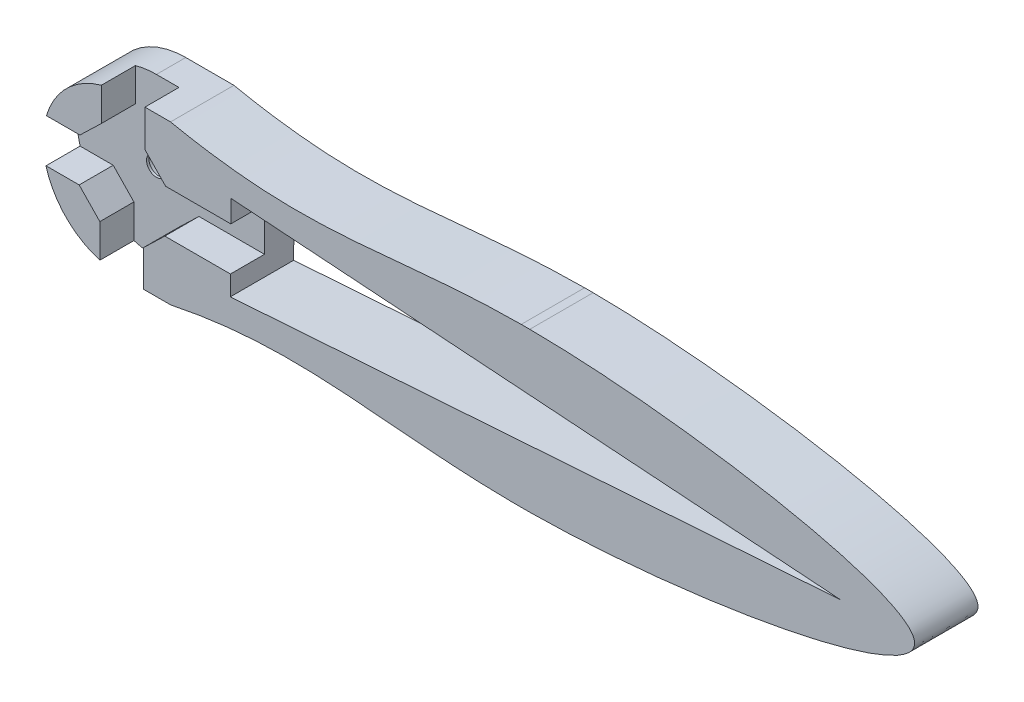
ISO-10303-21;
HEADER;
FILE_DESCRIPTION(('STEP AP214'),'2;1');
FILE_NAME('part.step','',(''),(''),'','','');
FILE_SCHEMA(('AUTOMOTIVE_DESIGN { 1 0 10303 214 1 1 1 1 }'));
ENDSEC;
DATA;
#1=APPLICATION_CONTEXT('core data for automotive mechanical design processes');
#2=APPLICATION_PROTOCOL_DEFINITION('international standard','automotive_design',2000,#1);
#3=PRODUCT_CONTEXT('',#1,'mechanical');
#4=PRODUCT('Part','Part','',(#3));
#5=PRODUCT_RELATED_PRODUCT_CATEGORY('part','',(#4));
#6=PRODUCT_DEFINITION_FORMATION('','',#4);
#7=PRODUCT_DEFINITION_CONTEXT('part definition',#1,'design');
#8=PRODUCT_DEFINITION('design','',#6,#7);
#9=PRODUCT_DEFINITION_SHAPE('','',#8);
#10=(LENGTH_UNIT() NAMED_UNIT(*) SI_UNIT(.MILLI.,.METRE.));
#11=(NAMED_UNIT(*) PLANE_ANGLE_UNIT() SI_UNIT($,.RADIAN.));
#12=(NAMED_UNIT(*) SI_UNIT($,.STERADIAN.) SOLID_ANGLE_UNIT());
#13=UNCERTAINTY_MEASURE_WITH_UNIT(LENGTH_MEASURE(1.E-05),#10,'distance_accuracy_value','');
#14=(GEOMETRIC_REPRESENTATION_CONTEXT(3) GLOBAL_UNCERTAINTY_ASSIGNED_CONTEXT((#13)) GLOBAL_UNIT_ASSIGNED_CONTEXT((#10,
#11,#12)) REPRESENTATION_CONTEXT('',''));
#15=CARTESIAN_POINT('',(0.,0.,0.));
#16=DIRECTION('',(0.,0.,1.));
#17=DIRECTION('',(1.,0.,0.));
#18=AXIS2_PLACEMENT_3D('',#15,#16,#17);
#19=CARTESIAN_POINT('',(0.,10.,8.));
#20=DIRECTION('',(0.,0.,-1.));
#21=DIRECTION('',(-1.,0.,0.));
#22=AXIS2_PLACEMENT_3D('',#19,#20,#21);
#23=PLANE('',#22);
#24=DIRECTION('',(0.99754531479736,0.0700238882513403,0.));
#25=VECTOR('',#24,1.);
#26=CARTESIAN_POINT('',(90.6551442776902,10.0481178062862,8.));
#27=LINE('',#26,#25);
#28=CARTESIAN_POINT('',(13.6163287176374,4.6402858694598,8.));
#29=VERTEX_POINT('',#28);
#30=CARTESIAN_POINT('',(90.6551442776902,10.0481178062862,8.));
#31=VERTEX_POINT('',#30);
#32=EDGE_CURVE('E224',#29,#31,#27,.T.);
#33=ORIENTED_EDGE('',*,*,#32,.F.);
#34=DIRECTION('',(-0.00874835726051306,-0.999961732390416,0.));
#35=VECTOR('',#34,1.);
#36=CARTESIAN_POINT('',(13.6163287176374,4.6402858694598,8.));
#37=LINE('',#36,#35);
#38=CARTESIAN_POINT('',(13.6383324761862,7.15537708743099,8.));
#39=VERTEX_POINT('',#38);
#40=EDGE_CURVE('E233',#39,#29,#37,.T.);
#41=ORIENTED_EDGE('',*,*,#40,.F.);
#42=DIRECTION('',(1.,0.,0.));
#43=VECTOR('',#42,1.);
#44=CARTESIAN_POINT('',(17.8180971034863,7.15537708743099,8.));
#45=LINE('',#44,#43);
#46=CARTESIAN_POINT('',(5.3597141305402,7.15537708743099,8.));
#47=VERTEX_POINT('',#46);
#48=EDGE_CURVE('E493',#47,#39,#45,.T.);
#49=ORIENTED_EDGE('',*,*,#48,.F.);
#50=DIRECTION('',(0.719369188088886,0.694627937264502,0.));
#51=VECTOR('',#50,1.);
#52=CARTESIAN_POINT('',(2.65537708743099,4.54405025688731,8.));
#53=LINE('',#52,#51);
#54=CARTESIAN_POINT('',(2.65537708743099,4.54405025688731,8.));
#55=VERTEX_POINT('',#54);
#56=EDGE_CURVE('E490',#55,#47,#53,.T.);
#57=ORIENTED_EDGE('',*,*,#56,.F.);
#58=DIRECTION('',(0.,1.,0.));
#59=VECTOR('',#58,1.);
#60=CARTESIAN_POINT('',(2.65537708743099,4.54405025688731,8.));
#61=LINE('',#60,#59);
#62=CARTESIAN_POINT('',(2.65537708743099,0.,8.));
#63=VERTEX_POINT('',#62);
#64=EDGE_CURVE('E372',#63,#55,#61,.T.);
#65=ORIENTED_EDGE('',*,*,#64,.F.);
#66=DIRECTION('',(1.,0.,0.));
#67=VECTOR('',#66,1.);
#68=CARTESIAN_POINT('',(0.,0.,8.));
#69=LINE('',#68,#67);
#70=CARTESIAN_POINT('',(6.07871364216808,0.,8.));
#71=VERTEX_POINT('',#70);
#72=EDGE_CURVE('E358',#63,#71,#69,.T.);
#73=ORIENTED_EDGE('',*,*,#72,.T.);
#74=CARTESIAN_POINT('',(6.07871364216805,20.,8.));
#75=CARTESIAN_POINT('',(-5.18394902423319,22.3429310877727,8.));
#76=CARTESIAN_POINT('',(-23.1517395103829,28.6346292808454,8.));
#77=CARTESIAN_POINT('',(-18.3293462074363,-7.41752010195064,8.));
#78=CARTESIAN_POINT('',(17.5692357205584,5.73226547633476,8.));
#79=CARTESIAN_POINT('',(44.5395748380323,-4.28840837775069,8.));
#80=CARTESIAN_POINT('',(129.17258816673,9.95529611012485,8.));
#81=CARTESIAN_POINT('',(43.7729465159057,24.459557564696,8.));
#82=CARTESIAN_POINT('',(24.915023513552,16.0815504038632,8.));
#83=CARTESIAN_POINT('',(6.07871364216805,20.,8.));
#84=B_SPLINE_CURVE_WITH_KNOTS('',3,(#74,#75,#76,#77,#78,#79,#80,#81,#82,#83),.UNSPECIFIED.,.T.,
.F.,(4,1,1,1,1,1,1,4),(0.,0.109135562905319,0.132702059093896,0.235664961885761,
0.418189409413175,0.617832480942881,0.817475552472586,1.),.UNSPECIFIED.);
#85=CARTESIAN_POINT('',(49.1099394503399,-2.04914549412939E-12,8.));
#86=VERTEX_POINT('',#85);
#87=EDGE_CURVE('E369',#71,#86,#84,.T.);
#88=ORIENTED_EDGE('',*,*,#87,.T.);
#89=CARTESIAN_POINT('',(51.4223114562844,0.,8.));
#90=VERTEX_POINT('',#89);
#91=EDGE_CURVE('E374',#86,#90,#69,.T.);
#92=ORIENTED_EDGE('',*,*,#91,.T.);
#93=CARTESIAN_POINT('',(51.4223114562801,20.,8.));
#94=VERTEX_POINT('',#93);
#95=EDGE_CURVE('E420',#90,#94,#84,.T.);
#96=ORIENTED_EDGE('',*,*,#95,.T.);
#97=DIRECTION('',(-1.,0.,0.));
#98=VECTOR('',#97,1.);
#99=CARTESIAN_POINT('',(0.,20.,8.));
#100=LINE('',#99,#98);
#101=CARTESIAN_POINT('',(50.3451744032018,20.,8.));
#102=VERTEX_POINT('',#101);
#103=EDGE_CURVE('E376',#94,#102,#100,.T.);
#104=ORIENTED_EDGE('',*,*,#103,.T.);
#105=CARTESIAN_POINT('',(6.07871364216805,20.,8.));
#106=VERTEX_POINT('',#105);
#107=EDGE_CURVE('E245',#102,#106,#84,.T.);
#108=ORIENTED_EDGE('',*,*,#107,.T.);
#109=CARTESIAN_POINT('',(2.84462291256901,20.,8.));
#110=VERTEX_POINT('',#109);
#111=EDGE_CURVE('E373',#106,#110,#100,.T.);
#112=ORIENTED_EDGE('',*,*,#111,.T.);
#113=DIRECTION('',(0.,1.,0.));
#114=VECTOR('',#113,1.);
#115=CARTESIAN_POINT('',(2.84462291256901,15.3597141305402,8.));
#116=LINE('',#115,#114);
#117=CARTESIAN_POINT('',(2.84462291256901,15.3597141305402,8.));
#118=VERTEX_POINT('',#117);
#119=EDGE_CURVE('E444',#118,#110,#116,.T.);
#120=ORIENTED_EDGE('',*,*,#119,.F.);
#121=DIRECTION('',(-0.694627937264501,0.719369188088887,0.));
#122=VECTOR('',#121,1.);
#123=CARTESIAN_POINT('',(5.45594974311269,12.655377087431,8.));
#124=LINE('',#123,#122);
#125=CARTESIAN_POINT('',(5.45594974311269,12.655377087431,8.));
#126=VERTEX_POINT('',#125);
#127=EDGE_CURVE('E498',#126,#118,#124,.T.);
#128=ORIENTED_EDGE('',*,*,#127,.F.);
#129=DIRECTION('',(-1.,0.,0.));
#130=VECTOR('',#129,1.);
#131=CARTESIAN_POINT('',(5.45594974311269,12.655377087431,8.));
#132=LINE('',#131,#130);
#133=CARTESIAN_POINT('',(13.6864502824725,12.655377087431,8.));
#134=VERTEX_POINT('',#133);
#135=EDGE_CURVE('E496',#134,#126,#132,.T.);
#136=ORIENTED_EDGE('',*,*,#135,.F.);
#137=CARTESIAN_POINT('',(13.7109516302064,15.4559497431127,8.));
#138=VERTEX_POINT('',#137);
#139=EDGE_CURVE('E221',#138,#134,#37,.T.);
#140=ORIENTED_EDGE('',*,*,#139,.F.);
#141=DIRECTION('',(-0.997539296015974,0.0701095778332397,0.));
#142=VECTOR('',#141,1.);
#143=CARTESIAN_POINT('',(13.7109516302064,15.4559497431127,8.));
#144=LINE('',#143,#142);
#145=EDGE_CURVE('E216',#31,#138,#144,.T.);
#146=ORIENTED_EDGE('',*,*,#145,.F.);
#147=EDGE_LOOP('',(#33,#41,#49,#57,#65,#73,#88,#92,#96,#104,#108,#112,#120,#128,#136,#140,#146));
#148=FACE_BOUND('',#147,.T.);
#149=ADVANCED_FACE('F36',(#148),#23,.F.);
#150=CARTESIAN_POINT('',(0.,0.,8.));
#151=DIRECTION('',(0.,1.,0.));
#152=DIRECTION('',(0.,0.,1.));
#153=AXIS2_PLACEMENT_3D('',#150,#151,#152);
#154=PLANE('',#153);
#155=DIRECTION('',(0.,0.,1.));
#156=VECTOR('',#155,1.);
#157=CARTESIAN_POINT('',(6.07871364216808,0.,-2.));
#158=LINE('',#157,#156);
#159=CARTESIAN_POINT('',(6.0787135491501,0.,0.));
#160=VERTEX_POINT('',#159);
#161=EDGE_CURVE('E355',#71,#160,#158,.F.);
#162=ORIENTED_EDGE('',*,*,#161,.F.);
#163=ORIENTED_EDGE('',*,*,#72,.F.);
#164=DIRECTION('',(0.,0.,-1.));
#165=VECTOR('',#164,1.);
#166=CARTESIAN_POINT('',(2.65537708743099,0.,8.));
#167=LINE('',#166,#165);
#168=CARTESIAN_POINT('',(2.65537708743099,0.,3.7));
#169=VERTEX_POINT('',#168);
#170=EDGE_CURVE('E541',#63,#169,#167,.T.);
#171=ORIENTED_EDGE('',*,*,#170,.T.);
#172=DIRECTION('',(-1.,0.,0.));
#173=VECTOR('',#172,1.);
#174=CARTESIAN_POINT('',(0.,0.,3.7));
#175=LINE('',#174,#173);
#176=CARTESIAN_POINT('',(0.,0.,3.7));
#177=VERTEX_POINT('',#176);
#178=EDGE_CURVE('E527',#169,#177,#175,.T.);
#179=ORIENTED_EDGE('',*,*,#178,.T.);
#180=DIRECTION('',(0.,0.,-1.));
#181=VECTOR('',#180,1.);
#182=CARTESIAN_POINT('',(0.,0.,8.));
#183=LINE('',#182,#181);
#184=CARTESIAN_POINT('',(0.,0.,0.));
#185=VERTEX_POINT('',#184);
#186=EDGE_CURVE('E395',#177,#185,#183,.T.);
#187=ORIENTED_EDGE('',*,*,#186,.T.);
#188=DIRECTION('',(1.,0.,0.));
#189=VECTOR('',#188,1.);
#190=CARTESIAN_POINT('',(0.,0.,0.));
#191=LINE('',#190,#189);
#192=EDGE_CURVE('E360',#185,#160,#191,.T.);
#193=ORIENTED_EDGE('',*,*,#192,.T.);
#194=EDGE_LOOP('',(#162,#163,#171,#179,#187,#193));
#195=FACE_BOUND('',#194,.T.);
#196=ADVANCED_FACE('F344',(#195),#154,.F.);
#197=DIRECTION('',(0.,0.,1.));
#198=VECTOR('',#197,1.);
#199=CARTESIAN_POINT('',(49.1099394503284,-1.94514509479961E-12,-2.));
#200=LINE('',#199,#198);
#201=CARTESIAN_POINT('',(49.1099394832346,-3.01009842661811E-10,0.));
#202=VERTEX_POINT('',#201);
#203=EDGE_CURVE('E364',#202,#86,#200,.T.);
#204=ORIENTED_EDGE('',*,*,#203,.F.);
#205=CARTESIAN_POINT('',(51.4223114281471,0.,0.));
#206=VERTEX_POINT('',#205);
#207=EDGE_CURVE('E386',#202,#206,#191,.T.);
#208=ORIENTED_EDGE('',*,*,#207,.T.);
#209=DIRECTION('',(0.,0.,1.));
#210=VECTOR('',#209,1.);
#211=CARTESIAN_POINT('',(51.4223114562844,0.,-2.));
#212=LINE('',#211,#210);
#213=EDGE_CURVE('E419',#90,#206,#212,.F.);
#214=ORIENTED_EDGE('',*,*,#213,.F.);
#215=ORIENTED_EDGE('',*,*,#91,.F.);
#216=EDGE_LOOP('',(#204,#208,#214,#215));
#217=FACE_BOUND('',#216,.T.);
#218=ADVANCED_FACE('F342',(#217),#154,.F.);
#219=CARTESIAN_POINT('',(0.,20.,8.));
#220=DIRECTION('',(0.,-1.,0.));
#221=DIRECTION('',(0.,0.,-1.));
#222=AXIS2_PLACEMENT_3D('',#219,#220,#221);
#223=PLANE('',#222);
#224=DIRECTION('',(0.,0.,1.));
#225=VECTOR('',#224,1.);
#226=CARTESIAN_POINT('',(51.4223114562794,20.,-2.));
#227=LINE('',#226,#225);
#228=CARTESIAN_POINT('',(51.4223110359447,20.0000000019914,0.));
#229=VERTEX_POINT('',#228);
#230=EDGE_CURVE('E363',#229,#94,#227,.T.);
#231=ORIENTED_EDGE('',*,*,#230,.F.);
#232=DIRECTION('',(-1.,0.,0.));
#233=VECTOR('',#232,1.);
#234=CARTESIAN_POINT('',(0.,20.,0.));
#235=LINE('',#234,#233);
#236=CARTESIAN_POINT('',(50.3451749231542,20.,0.));
#237=VERTEX_POINT('',#236);
#238=EDGE_CURVE('E391',#229,#237,#235,.T.);
#239=ORIENTED_EDGE('',*,*,#238,.T.);
#240=DIRECTION('',(0.,0.,1.));
#241=VECTOR('',#240,1.);
#242=CARTESIAN_POINT('',(50.3451744031985,20.,-2.));
#243=LINE('',#242,#241);
#244=EDGE_CURVE('E426',#102,#237,#243,.F.);
#245=ORIENTED_EDGE('',*,*,#244,.F.);
#246=ORIENTED_EDGE('',*,*,#103,.F.);
#247=EDGE_LOOP('',(#231,#239,#245,#246));
#248=FACE_BOUND('',#247,.T.);
#249=ADVANCED_FACE('F340',(#248),#223,.F.);
#250=DIRECTION('',(0.,0.,1.));
#251=VECTOR('',#250,1.);
#252=CARTESIAN_POINT('',(6.07871364216784,20.,-2.));
#253=LINE('',#252,#251);
#254=CARTESIAN_POINT('',(6.07871364216805,20.,0.));
#255=VERTEX_POINT('',#254);
#256=EDGE_CURVE('E424',#255,#106,#253,.T.);
#257=ORIENTED_EDGE('',*,*,#256,.F.);
#258=CARTESIAN_POINT('',(0.,20.,0.));
#259=VERTEX_POINT('',#258);
#260=EDGE_CURVE('E389',#255,#259,#235,.T.);
#261=ORIENTED_EDGE('',*,*,#260,.T.);
#262=DIRECTION('',(0.,0.,-1.));
#263=VECTOR('',#262,1.);
#264=CARTESIAN_POINT('',(0.,20.,8.));
#265=LINE('',#264,#263);
#266=CARTESIAN_POINT('',(0.,20.,3.7));
#267=VERTEX_POINT('',#266);
#268=EDGE_CURVE('E392',#267,#259,#265,.T.);
#269=ORIENTED_EDGE('',*,*,#268,.F.);
#270=DIRECTION('',(1.,0.,0.));
#271=VECTOR('',#270,1.);
#272=CARTESIAN_POINT('',(0.,20.,3.7));
#273=LINE('',#272,#271);
#274=CARTESIAN_POINT('',(2.84462291256901,20.,3.7));
#275=VERTEX_POINT('',#274);
#276=EDGE_CURVE('E505',#267,#275,#273,.T.);
#277=ORIENTED_EDGE('',*,*,#276,.T.);
#278=DIRECTION('',(0.,0.,1.));
#279=VECTOR('',#278,1.);
#280=CARTESIAN_POINT('',(2.84462291256901,20.,8.));
#281=LINE('',#280,#279);
#282=EDGE_CURVE('E543',#275,#110,#281,.T.);
#283=ORIENTED_EDGE('',*,*,#282,.T.);
#284=ORIENTED_EDGE('',*,*,#111,.F.);
#285=EDGE_LOOP('',(#257,#261,#269,#277,#283,#284));
#286=FACE_BOUND('',#285,.T.);
#287=ADVANCED_FACE('F338',(#286),#223,.F.);
#288=CARTESIAN_POINT('',(0.,10.,0.));
#289=DIRECTION('',(0.,0.,-1.));
#290=DIRECTION('',(-1.,0.,0.));
#291=AXIS2_PLACEMENT_3D('',#288,#289,#290);
#292=PLANE('',#291);
#293=DIRECTION('',(-0.99754531479736,-0.0700238882513403,0.));
#294=VECTOR('',#293,1.);
#295=CARTESIAN_POINT('',(0.441152316610904,3.71543858050773,0.));
#296=LINE('',#295,#294);
#297=CARTESIAN_POINT('',(90.6551442776902,10.0481178062862,0.));
#298=VERTEX_POINT('',#297);
#299=CARTESIAN_POINT('',(13.6163287176374,4.6402858694598,0.));
#300=VERTEX_POINT('',#299);
#301=EDGE_CURVE('E12',#298,#300,#296,.T.);
#302=ORIENTED_EDGE('',*,*,#301,.F.);
#303=DIRECTION('',(0.997539296015974,-0.0701095778332397,0.));
#304=VECTOR('',#303,1.);
#305=CARTESIAN_POINT('',(0.448967244536948,16.3880354566518,0.));
#306=LINE('',#305,#304);
#307=CARTESIAN_POINT('',(13.7109516302064,15.4559497431127,0.));
#308=VERTEX_POINT('',#307);
#309=EDGE_CURVE('E44',#308,#298,#306,.T.);
#310=ORIENTED_EDGE('',*,*,#309,.F.);
#311=DIRECTION('',(0.00874835726051306,0.999961732390416,0.));
#312=VECTOR('',#311,1.);
#313=CARTESIAN_POINT('',(13.6621735085846,9.88047385121179,0.));
#314=LINE('',#313,#312);
#315=EDGE_CURVE('E243',#300,#308,#314,.T.);
#316=ORIENTED_EDGE('',*,*,#315,.F.);
#317=EDGE_LOOP('',(#302,#310,#316));
#318=FACE_BOUND('',#317,.T.);
#319=CARTESIAN_POINT('',(0.,10.,0.));
#320=DIRECTION('',(0.,0.,-1.));
#321=DIRECTION('',(-1.,0.,0.));
#322=AXIS2_PLACEMENT_3D('',#319,#320,#321);
#323=CIRCLE('',#322,2.5);
#324=CARTESIAN_POINT('',(-2.5,10.,0.));
#325=VERTEX_POINT('',#324);
#326=EDGE_CURVE('E432',#325,#325,#323,.T.);
#327=ORIENTED_EDGE('',*,*,#326,.F.);
#328=EDGE_LOOP('',(#327));
#329=FACE_BOUND('',#328,.T.);
#330=ORIENTED_EDGE('',*,*,#260,.F.);
#331=CARTESIAN_POINT('',(6.07871364216805,20.,0.));
#332=CARTESIAN_POINT('',(-5.18394902423319,22.3429310877727,0.));
#333=CARTESIAN_POINT('',(-23.1517395103829,28.6346292808454,0.));
#334=CARTESIAN_POINT('',(-18.3293462074363,-7.41752010195064,0.));
#335=CARTESIAN_POINT('',(17.5692357205584,5.73226547633476,0.));
#336=CARTESIAN_POINT('',(44.5395748380323,-4.28840837775069,0.));
#337=CARTESIAN_POINT('',(129.17258816673,9.95529611012485,0.));
#338=CARTESIAN_POINT('',(43.7729465159057,24.459557564696,0.));
#339=CARTESIAN_POINT('',(24.915023513552,16.0815504038632,0.));
#340=CARTESIAN_POINT('',(6.07871364216805,20.,0.));
#341=B_SPLINE_CURVE_WITH_KNOTS('',3,(#331,#332,#333,#334,#335,#336,#337,#338,#339,#340),
.UNSPECIFIED.,.T.,.F.,(4,1,1,1,1,1,1,4),(0.,0.109135562905319,0.132702059093896,
0.235664961885761,0.418189409413175,0.617832480942881,0.817475552472586,1.),.UNSPECIFIED.);
#342=EDGE_CURVE('E402',#255,#237,#341,.F.);
#343=ORIENTED_EDGE('',*,*,#342,.T.);
#344=ORIENTED_EDGE('',*,*,#238,.F.);
#345=EDGE_CURVE('E401',#229,#206,#341,.F.);
#346=ORIENTED_EDGE('',*,*,#345,.T.);
#347=ORIENTED_EDGE('',*,*,#207,.F.);
#348=EDGE_CURVE('E397',#202,#160,#341,.F.);
#349=ORIENTED_EDGE('',*,*,#348,.T.);
#350=ORIENTED_EDGE('',*,*,#192,.F.);
#351=CARTESIAN_POINT('',(0.,10.,0.));
#352=DIRECTION('',(0.,0.,1.));
#353=DIRECTION('',(-1.,0.,0.));
#354=AXIS2_PLACEMENT_3D('',#351,#352,#353);
#355=CIRCLE('',#354,10.);
#356=EDGE_CURVE('E383',#259,#185,#355,.T.);
#357=ORIENTED_EDGE('',*,*,#356,.F.);
#358=EDGE_LOOP('',(#330,#343,#344,#346,#347,#349,#350,#357));
#359=FACE_BOUND('',#358,.T.);
#360=ADVANCED_FACE('F335',(#318,#329,#359),#292,.T.);
#361=CARTESIAN_POINT('',(0.,10.,8.));
#362=DIRECTION('',(0.,0.,1.));
#363=DIRECTION('',(-1.,0.,0.));
#364=AXIS2_PLACEMENT_3D('',#361,#362,#363);
#365=CIRCLE('',#364,10.);
#366=CARTESIAN_POINT('',(-9.64100474657837,7.34462291256902,8.));
#367=VERTEX_POINT('',#366);
#368=CARTESIAN_POINT('',(-2.84462291256901,0.413127700585169,8.));
#369=VERTEX_POINT('',#368);
#370=EDGE_CURVE('E380',#367,#369,#365,.T.);
#371=ORIENTED_EDGE('',*,*,#370,.T.);
#372=DIRECTION('',(0.,-1.,0.));
#373=VECTOR('',#372,1.);
#374=CARTESIAN_POINT('',(-2.84462291256901,-1.91236576595265,8.));
#375=LINE('',#374,#373);
#376=CARTESIAN_POINT('',(-2.84462291256901,4.6402858694598,8.));
#377=VERTEX_POINT('',#376);
#378=EDGE_CURVE('E487',#377,#369,#375,.T.);
#379=ORIENTED_EDGE('',*,*,#378,.F.);
#380=DIRECTION('',(0.694627937264501,-0.719369188088887,0.));
#381=VECTOR('',#380,1.);
#382=CARTESIAN_POINT('',(-5.45594974311269,7.34462291256902,8.));
#383=LINE('',#382,#381);
#384=CARTESIAN_POINT('',(-5.45594974311269,7.34462291256902,8.));
#385=VERTEX_POINT('',#384);
#386=EDGE_CURVE('E484',#385,#377,#383,.T.);
#387=ORIENTED_EDGE('',*,*,#386,.F.);
#388=DIRECTION('',(1.,0.,0.));
#389=VECTOR('',#388,1.);
#390=CARTESIAN_POINT('',(-5.45594974311269,7.34462291256902,8.));
#391=LINE('',#390,#389);
#392=EDGE_CURVE('E482',#367,#385,#391,.T.);
#393=ORIENTED_EDGE('',*,*,#392,.F.);
#394=EDGE_LOOP('',(#371,#379,#387,#393));
#395=FACE_BOUND('',#394,.T.);
#396=ADVANCED_FACE('F334',(#395),#23,.F.);
#397=CARTESIAN_POINT('',(0.,10.,8.));
#398=DIRECTION('',(0.,0.,-1.));
#399=DIRECTION('',(-1.,0.,0.));
#400=AXIS2_PLACEMENT_3D('',#397,#398,#399);
#401=CYLINDRICAL_SURFACE('',#400,10.);
#402=CARTESIAN_POINT('',(-2.65537708743099,19.6410047465784,8.));
#403=VERTEX_POINT('',#402);
#404=CARTESIAN_POINT('',(-9.58687229941484,12.844622912569,8.));
#405=VERTEX_POINT('',#404);
#406=EDGE_CURVE('E378',#403,#405,#365,.T.);
#407=ORIENTED_EDGE('',*,*,#406,.F.);
#408=DIRECTION('',(0.,0.,-1.));
#409=VECTOR('',#408,1.);
#410=CARTESIAN_POINT('',(-2.65537708743099,19.6410047465784,8.));
#411=LINE('',#410,#409);
#412=CARTESIAN_POINT('',(-2.65537708743099,19.6410047465784,3.7));
#413=VERTEX_POINT('',#412);
#414=EDGE_CURVE('E387',#403,#413,#411,.T.);
#415=ORIENTED_EDGE('',*,*,#414,.T.);
#416=CARTESIAN_POINT('',(0.,10.,3.7));
#417=DIRECTION('',(0.,0.,-1.));
#418=DIRECTION('',(-1.,0.,0.));
#419=AXIS2_PLACEMENT_3D('',#416,#417,#418);
#420=CIRCLE('',#419,10.);
#421=EDGE_CURVE('E524',#413,#267,#420,.T.);
#422=ORIENTED_EDGE('',*,*,#421,.T.);
#423=ORIENTED_EDGE('',*,*,#268,.T.);
#424=ORIENTED_EDGE('',*,*,#356,.T.);
#425=ORIENTED_EDGE('',*,*,#186,.F.);
#426=CARTESIAN_POINT('',(-2.84462291256901,0.413127700585169,3.7));
#427=VERTEX_POINT('',#426);
#428=EDGE_CURVE('E529',#177,#427,#420,.T.);
#429=ORIENTED_EDGE('',*,*,#428,.T.);
#430=DIRECTION('',(0.,0.,-1.));
#431=VECTOR('',#430,1.);
#432=CARTESIAN_POINT('',(-2.84462291256901,0.413127700585171,8.));
#433=LINE('',#432,#431);
#434=EDGE_CURVE('E538',#427,#369,#433,.F.);
#435=ORIENTED_EDGE('',*,*,#434,.T.);
#436=ORIENTED_EDGE('',*,*,#370,.F.);
#437=DIRECTION('',(0.,0.,-1.));
#438=VECTOR('',#437,1.);
#439=CARTESIAN_POINT('',(-9.64100474657837,7.34462291256902,8.));
#440=LINE('',#439,#438);
#441=CARTESIAN_POINT('',(-9.64100474657837,7.34462291256902,3.7));
#442=VERTEX_POINT('',#441);
#443=EDGE_CURVE('E535',#367,#442,#440,.T.);
#444=ORIENTED_EDGE('',*,*,#443,.T.);
#445=CARTESIAN_POINT('',(-9.58687229941484,12.844622912569,3.7));
#446=VERTEX_POINT('',#445);
#447=EDGE_CURVE('E528',#442,#446,#420,.T.);
#448=ORIENTED_EDGE('',*,*,#447,.T.);
#449=DIRECTION('',(0.,0.,-1.));
#450=VECTOR('',#449,1.);
#451=CARTESIAN_POINT('',(-9.58687229941484,12.844622912569,8.));
#452=LINE('',#451,#450);
#453=EDGE_CURVE('E532',#446,#405,#452,.F.);
#454=ORIENTED_EDGE('',*,*,#453,.T.);
#455=EDGE_LOOP('',(#407,#415,#422,#423,#424,#425,#429,#435,#436,#444,#448,#454));
#456=FACE_BOUND('',#455,.T.);
#457=ADVANCED_FACE('F38',(#456),#401,.T.);
#458=DIRECTION('',(-0.719369188088887,-0.694627937264501,0.));
#459=VECTOR('',#458,1.);
#460=CARTESIAN_POINT('',(-2.65537708743099,15.4559497431127,8.));
#461=LINE('',#460,#459);
#462=CARTESIAN_POINT('',(-2.65537708743099,15.4559497431127,8.));
#463=VERTEX_POINT('',#462);
#464=CARTESIAN_POINT('',(-5.3597141305402,12.844622912569,8.));
#465=VERTEX_POINT('',#464);
#466=EDGE_CURVE('E477',#463,#465,#461,.T.);
#467=ORIENTED_EDGE('',*,*,#466,.F.);
#468=DIRECTION('',(0.,-1.,0.));
#469=VECTOR('',#468,1.);
#470=CARTESIAN_POINT('',(-2.65537708743099,15.4559497431127,8.));
#471=LINE('',#470,#469);
#472=EDGE_CURVE('E438',#403,#463,#471,.T.);
#473=ORIENTED_EDGE('',*,*,#472,.F.);
#474=ORIENTED_EDGE('',*,*,#406,.T.);
#475=DIRECTION('',(-1.,0.,0.));
#476=VECTOR('',#475,1.);
#477=CARTESIAN_POINT('',(-5.3597141305402,12.844622912569,8.));
#478=LINE('',#477,#476);
#479=EDGE_CURVE('E480',#465,#405,#478,.T.);
#480=ORIENTED_EDGE('',*,*,#479,.F.);
#481=EDGE_LOOP('',(#467,#473,#474,#480));
#482=FACE_BOUND('',#481,.T.);
#483=ADVANCED_FACE('F326',(#482),#23,.F.);
#484=CARTESIAN_POINT('',(-2.65537708743099,15.4559497431127,3.7));
#485=DIRECTION('',(-1.,0.,0.));
#486=DIRECTION('',(0.,0.,1.));
#487=AXIS2_PLACEMENT_3D('',#484,#485,#486);
#488=PLANE('',#487);
#489=ORIENTED_EDGE('',*,*,#472,.T.);
#490=DIRECTION('',(0.,0.,1.));
#491=VECTOR('',#490,1.);
#492=CARTESIAN_POINT('',(-2.65537708743099,15.4559497431127,3.7));
#493=LINE('',#492,#491);
#494=CARTESIAN_POINT('',(-2.65537708743099,15.4559497431127,3.7));
#495=VERTEX_POINT('',#494);
#496=EDGE_CURVE('E474',#495,#463,#493,.T.);
#497=ORIENTED_EDGE('',*,*,#496,.F.);
#498=DIRECTION('',(0.,-1.,0.));
#499=VECTOR('',#498,1.);
#500=CARTESIAN_POINT('',(-2.65537708743099,15.4559497431127,3.7));
#501=LINE('',#500,#499);
#502=EDGE_CURVE('E441',#413,#495,#501,.T.);
#503=ORIENTED_EDGE('',*,*,#502,.F.);
#504=ORIENTED_EDGE('',*,*,#414,.F.);
#505=EDGE_LOOP('',(#489,#497,#503,#504));
#506=FACE_BOUND('',#505,.T.);
#507=ADVANCED_FACE('F283',(#506),#488,.F.);
#508=CARTESIAN_POINT('',(2.84462291256901,15.3597141305402,3.7));
#509=DIRECTION('',(1.,0.,0.));
#510=DIRECTION('',(0.,0.,-1.));
#511=AXIS2_PLACEMENT_3D('',#508,#509,#510);
#512=PLANE('',#511);
#513=DIRECTION('',(0.,1.,0.));
#514=VECTOR('',#513,1.);
#515=CARTESIAN_POINT('',(2.84462291256901,15.3597141305402,3.7));
#516=LINE('',#515,#514);
#517=CARTESIAN_POINT('',(2.84462291256901,15.3597141305402,3.7));
#518=VERTEX_POINT('',#517);
#519=EDGE_CURVE('E471',#518,#275,#516,.T.);
#520=ORIENTED_EDGE('',*,*,#519,.F.);
#521=DIRECTION('',(0.,0.,1.));
#522=VECTOR('',#521,1.);
#523=CARTESIAN_POINT('',(2.84462291256901,15.3597141305402,3.7));
#524=LINE('',#523,#522);
#525=EDGE_CURVE('E503',#518,#118,#524,.T.);
#526=ORIENTED_EDGE('',*,*,#525,.T.);
#527=ORIENTED_EDGE('',*,*,#119,.T.);
#528=ORIENTED_EDGE('',*,*,#282,.F.);
#529=EDGE_LOOP('',(#520,#526,#527,#528));
#530=FACE_BOUND('',#529,.T.);
#531=ADVANCED_FACE('F279',(#530),#512,.F.);
#532=CARTESIAN_POINT('',(2.65537708743099,4.54405025688731,3.7));
#533=DIRECTION('',(1.,0.,0.));
#534=DIRECTION('',(0.,0.,-1.));
#535=AXIS2_PLACEMENT_3D('',#532,#533,#534);
#536=PLANE('',#535);
#537=ORIENTED_EDGE('',*,*,#64,.T.);
#538=DIRECTION('',(0.,0.,1.));
#539=VECTOR('',#538,1.);
#540=CARTESIAN_POINT('',(2.65537708743099,4.54405025688731,3.7));
#541=LINE('',#540,#539);
#542=CARTESIAN_POINT('',(2.65537708743099,4.54405025688731,3.7));
#543=VERTEX_POINT('',#542);
#544=EDGE_CURVE('E511',#543,#55,#541,.T.);
#545=ORIENTED_EDGE('',*,*,#544,.F.);
#546=DIRECTION('',(0.,1.,0.));
#547=VECTOR('',#546,1.);
#548=CARTESIAN_POINT('',(2.65537708743099,4.54405025688731,3.7));
#549=LINE('',#548,#547);
#550=EDGE_CURVE('E458',#169,#543,#549,.T.);
#551=ORIENTED_EDGE('',*,*,#550,.F.);
#552=ORIENTED_EDGE('',*,*,#170,.F.);
#553=EDGE_LOOP('',(#537,#545,#551,#552));
#554=FACE_BOUND('',#553,.T.);
#555=ADVANCED_FACE('F282',(#554),#536,.F.);
#556=CARTESIAN_POINT('',(-2.84462291256901,-1.91236576595265,3.7));
#557=DIRECTION('',(-1.,0.,0.));
#558=DIRECTION('',(0.,0.,1.));
#559=AXIS2_PLACEMENT_3D('',#556,#557,#558);
#560=PLANE('',#559);
#561=DIRECTION('',(0.,-1.,0.));
#562=VECTOR('',#561,1.);
#563=CARTESIAN_POINT('',(-2.84462291256901,-1.91236576595265,3.7));
#564=LINE('',#563,#562);
#565=CARTESIAN_POINT('',(-2.84462291256901,4.6402858694598,3.7));
#566=VERTEX_POINT('',#565);
#567=EDGE_CURVE('E455',#566,#427,#564,.T.);
#568=ORIENTED_EDGE('',*,*,#567,.F.);
#569=DIRECTION('',(0.,0.,1.));
#570=VECTOR('',#569,1.);
#571=CARTESIAN_POINT('',(-2.84462291256901,4.6402858694598,3.7));
#572=LINE('',#571,#570);
#573=EDGE_CURVE('E514',#566,#377,#572,.T.);
#574=ORIENTED_EDGE('',*,*,#573,.T.);
#575=ORIENTED_EDGE('',*,*,#378,.T.);
#576=ORIENTED_EDGE('',*,*,#434,.F.);
#577=EDGE_LOOP('',(#568,#574,#575,#576));
#578=FACE_BOUND('',#577,.T.);
#579=ADVANCED_FACE('F305',(#578),#560,.F.);
#580=CARTESIAN_POINT('',(-5.45594974311269,7.34462291256902,3.7));
#581=DIRECTION('',(0.,-1.,0.));
#582=DIRECTION('',(0.,0.,-1.));
#583=AXIS2_PLACEMENT_3D('',#580,#581,#582);
#584=PLANE('',#583);
#585=ORIENTED_EDGE('',*,*,#392,.T.);
#586=DIRECTION('',(0.,0.,1.));
#587=VECTOR('',#586,1.);
#588=CARTESIAN_POINT('',(-5.45594974311269,7.34462291256902,3.7));
#589=LINE('',#588,#587);
#590=CARTESIAN_POINT('',(-5.45594974311269,7.34462291256902,3.7));
#591=VERTEX_POINT('',#590);
#592=EDGE_CURVE('E516',#591,#385,#589,.T.);
#593=ORIENTED_EDGE('',*,*,#592,.F.);
#594=DIRECTION('',(1.,0.,0.));
#595=VECTOR('',#594,1.);
#596=CARTESIAN_POINT('',(-5.45594974311269,7.34462291256902,3.7));
#597=LINE('',#596,#595);
#598=EDGE_CURVE('E450',#442,#591,#597,.T.);
#599=ORIENTED_EDGE('',*,*,#598,.F.);
#600=ORIENTED_EDGE('',*,*,#443,.F.);
#601=EDGE_LOOP('',(#585,#593,#599,#600));
#602=FACE_BOUND('',#601,.T.);
#603=ADVANCED_FACE('F309',(#602),#584,.F.);
#604=CARTESIAN_POINT('',(-5.3597141305402,12.844622912569,3.7));
#605=DIRECTION('',(0.,1.,0.));
#606=DIRECTION('',(0.,0.,1.));
#607=AXIS2_PLACEMENT_3D('',#604,#605,#606);
#608=PLANE('',#607);
#609=DIRECTION('',(-1.,0.,0.));
#610=VECTOR('',#609,1.);
#611=CARTESIAN_POINT('',(-5.3597141305402,12.844622912569,3.7));
#612=LINE('',#611,#610);
#613=CARTESIAN_POINT('',(-5.3597141305402,12.844622912569,3.7));
#614=VERTEX_POINT('',#613);
#615=EDGE_CURVE('E447',#614,#446,#612,.T.);
#616=ORIENTED_EDGE('',*,*,#615,.F.);
#617=DIRECTION('',(0.,0.,1.));
#618=VECTOR('',#617,1.);
#619=CARTESIAN_POINT('',(-5.3597141305402,12.844622912569,3.7));
#620=LINE('',#619,#618);
#621=EDGE_CURVE('E519',#614,#465,#620,.T.);
#622=ORIENTED_EDGE('',*,*,#621,.T.);
#623=ORIENTED_EDGE('',*,*,#479,.T.);
#624=ORIENTED_EDGE('',*,*,#453,.F.);
#625=EDGE_LOOP('',(#616,#622,#623,#624));
#626=FACE_BOUND('',#625,.T.);
#627=ADVANCED_FACE('F289',(#626),#608,.F.);
#628=CARTESIAN_POINT('',(5.45594974311269,12.655377087431,3.7));
#629=DIRECTION('',(0.719369188088887,0.694627937264501,0.));
#630=DIRECTION('',(-0.694627937264501,0.719369188088887,0.));
#631=AXIS2_PLACEMENT_3D('',#628,#629,#630);
#632=PLANE('',#631);
#633=ORIENTED_EDGE('',*,*,#127,.T.);
#634=ORIENTED_EDGE('',*,*,#525,.F.);
#635=DIRECTION('',(-0.694627937264501,0.719369188088887,0.));
#636=VECTOR('',#635,1.);
#637=CARTESIAN_POINT('',(5.45594974311269,12.655377087431,3.7));
#638=LINE('',#637,#636);
#639=CARTESIAN_POINT('',(5.45594974311269,12.655377087431,3.7));
#640=VERTEX_POINT('',#639);
#641=EDGE_CURVE('E468',#640,#518,#638,.T.);
#642=ORIENTED_EDGE('',*,*,#641,.F.);
#643=DIRECTION('',(0.,0.,1.));
#644=VECTOR('',#643,1.);
#645=CARTESIAN_POINT('',(5.45594974311269,12.655377087431,3.7));
#646=LINE('',#645,#644);
#647=EDGE_CURVE('E506',#640,#126,#646,.T.);
#648=ORIENTED_EDGE('',*,*,#647,.T.);
#649=EDGE_LOOP('',(#633,#634,#642,#648));
#650=FACE_BOUND('',#649,.T.);
#651=ADVANCED_FACE('F285',(#650),#632,.F.);
#652=CARTESIAN_POINT('',(5.45594974311269,12.655377087431,3.7));
#653=DIRECTION('',(0.,1.,0.));
#654=DIRECTION('',(0.,0.,1.));
#655=AXIS2_PLACEMENT_3D('',#652,#653,#654);
#656=PLANE('',#655);
#657=DIRECTION('',(-1.,0.,0.));
#658=VECTOR('',#657,1.);
#659=CARTESIAN_POINT('',(12.0086013785251,12.655377087431,3.7));
#660=LINE('',#659,#658);
#661=CARTESIAN_POINT('',(13.6864502824725,12.655377087431,3.7));
#662=VERTEX_POINT('',#661);
#663=EDGE_CURVE('E466',#662,#640,#660,.T.);
#664=ORIENTED_EDGE('',*,*,#663,.F.);
#665=DIRECTION('',(0.,0.,1.));
#666=VECTOR('',#665,1.);
#667=CARTESIAN_POINT('',(13.6864502824725,12.655377087431,3.7));
#668=LINE('',#667,#666);
#669=EDGE_CURVE('E59',#662,#134,#668,.T.);
#670=ORIENTED_EDGE('',*,*,#669,.T.);
#671=ORIENTED_EDGE('',*,*,#135,.T.);
#672=ORIENTED_EDGE('',*,*,#647,.F.);
#673=EDGE_LOOP('',(#664,#670,#671,#672));
#674=FACE_BOUND('',#673,.T.);
#675=ADVANCED_FACE('F288',(#674),#656,.F.);
#676=CARTESIAN_POINT('',(17.8180971034863,7.15537708743099,3.7));
#677=DIRECTION('',(0.,-1.,0.));
#678=DIRECTION('',(0.,0.,-1.));
#679=AXIS2_PLACEMENT_3D('',#676,#677,#678);
#680=PLANE('',#679);
#681=ORIENTED_EDGE('',*,*,#48,.T.);
#682=DIRECTION('',(0.,0.,-1.));
#683=VECTOR('',#682,1.);
#684=CARTESIAN_POINT('',(13.6383324761862,7.15537708743099,3.7));
#685=LINE('',#684,#683);
#686=CARTESIAN_POINT('',(13.6383324761862,7.15537708743099,3.7));
#687=VERTEX_POINT('',#686);
#688=EDGE_CURVE('E238',#39,#687,#685,.T.);
#689=ORIENTED_EDGE('',*,*,#688,.T.);
#690=DIRECTION('',(1.,0.,0.));
#691=VECTOR('',#690,1.);
#692=CARTESIAN_POINT('',(5.3597141305402,7.15537708743099,3.7));
#693=LINE('',#692,#691);
#694=CARTESIAN_POINT('',(5.3597141305402,7.15537708743099,3.7));
#695=VERTEX_POINT('',#694);
#696=EDGE_CURVE('E463',#695,#687,#693,.T.);
#697=ORIENTED_EDGE('',*,*,#696,.F.);
#698=DIRECTION('',(0.,0.,1.));
#699=VECTOR('',#698,1.);
#700=CARTESIAN_POINT('',(5.3597141305402,7.15537708743099,3.7));
#701=LINE('',#700,#699);
#702=EDGE_CURVE('E509',#695,#47,#701,.T.);
#703=ORIENTED_EDGE('',*,*,#702,.T.);
#704=EDGE_LOOP('',(#681,#689,#697,#703));
#705=FACE_BOUND('',#704,.T.);
#706=ADVANCED_FACE('F293',(#705),#680,.F.);
#707=CARTESIAN_POINT('',(2.65537708743099,4.54405025688731,3.7));
#708=DIRECTION('',(0.694627937264502,-0.719369188088886,0.));
#709=DIRECTION('',(0.719369188088886,0.694627937264502,0.));
#710=AXIS2_PLACEMENT_3D('',#707,#708,#709);
#711=PLANE('',#710);
#712=ORIENTED_EDGE('',*,*,#56,.T.);
#713=ORIENTED_EDGE('',*,*,#702,.F.);
#714=DIRECTION('',(0.719369188088886,0.694627937264502,0.));
#715=VECTOR('',#714,1.);
#716=CARTESIAN_POINT('',(2.65537708743099,4.54405025688731,3.7));
#717=LINE('',#716,#715);
#718=EDGE_CURVE('E460',#543,#695,#717,.T.);
#719=ORIENTED_EDGE('',*,*,#718,.F.);
#720=ORIENTED_EDGE('',*,*,#544,.T.);
#721=EDGE_LOOP('',(#712,#713,#719,#720));
#722=FACE_BOUND('',#721,.T.);
#723=ADVANCED_FACE('F297',(#722),#711,.F.);
#724=CARTESIAN_POINT('',(-5.45594974311269,7.34462291256902,3.7));
#725=DIRECTION('',(-0.719369188088887,-0.694627937264501,0.));
#726=DIRECTION('',(0.694627937264501,-0.719369188088887,0.));
#727=AXIS2_PLACEMENT_3D('',#724,#725,#726);
#728=PLANE('',#727);
#729=ORIENTED_EDGE('',*,*,#386,.T.);
#730=ORIENTED_EDGE('',*,*,#573,.F.);
#731=DIRECTION('',(0.694627937264501,-0.719369188088887,0.));
#732=VECTOR('',#731,1.);
#733=CARTESIAN_POINT('',(-5.45594974311269,7.34462291256902,3.7));
#734=LINE('',#733,#732);
#735=EDGE_CURVE('E452',#591,#566,#734,.T.);
#736=ORIENTED_EDGE('',*,*,#735,.F.);
#737=ORIENTED_EDGE('',*,*,#592,.T.);
#738=EDGE_LOOP('',(#729,#730,#736,#737));
#739=FACE_BOUND('',#738,.T.);
#740=ADVANCED_FACE('F301',(#739),#728,.F.);
#741=CARTESIAN_POINT('',(-2.65537708743099,15.4559497431127,3.7));
#742=DIRECTION('',(-0.694627937264501,0.719369188088887,0.));
#743=DIRECTION('',(-0.719369188088887,-0.694627937264501,0.));
#744=AXIS2_PLACEMENT_3D('',#741,#742,#743);
#745=PLANE('',#744);
#746=ORIENTED_EDGE('',*,*,#466,.T.);
#747=ORIENTED_EDGE('',*,*,#621,.F.);
#748=DIRECTION('',(-0.719369188088887,-0.694627937264501,0.));
#749=VECTOR('',#748,1.);
#750=CARTESIAN_POINT('',(-2.65537708743099,15.4559497431127,3.7));
#751=LINE('',#750,#749);
#752=EDGE_CURVE('E443',#495,#614,#751,.T.);
#753=ORIENTED_EDGE('',*,*,#752,.F.);
#754=ORIENTED_EDGE('',*,*,#496,.T.);
#755=EDGE_LOOP('',(#746,#747,#753,#754));
#756=FACE_BOUND('',#755,.T.);
#757=ADVANCED_FACE('F313',(#756),#745,.F.);
#758=CARTESIAN_POINT('',(0.,10.,3.7));
#759=DIRECTION('',(0.,0.,1.));
#760=DIRECTION('',(1.,0.,0.));
#761=AXIS2_PLACEMENT_3D('',#758,#759,#760);
#762=PLANE('',#761);
#763=DIRECTION('',(-0.00874835726051306,-0.999961732390416,0.));
#764=VECTOR('',#763,1.);
#765=CARTESIAN_POINT('',(13.6621735085846,9.88047385121179,3.7));
#766=LINE('',#765,#764);
#767=EDGE_CURVE('E403',#662,#687,#766,.T.);
#768=ORIENTED_EDGE('',*,*,#767,.F.);
#769=ORIENTED_EDGE('',*,*,#663,.T.);
#770=ORIENTED_EDGE('',*,*,#641,.T.);
#771=ORIENTED_EDGE('',*,*,#519,.T.);
#772=ORIENTED_EDGE('',*,*,#276,.F.);
#773=ORIENTED_EDGE('',*,*,#421,.F.);
#774=ORIENTED_EDGE('',*,*,#502,.T.);
#775=ORIENTED_EDGE('',*,*,#752,.T.);
#776=ORIENTED_EDGE('',*,*,#615,.T.);
#777=ORIENTED_EDGE('',*,*,#447,.F.);
#778=ORIENTED_EDGE('',*,*,#598,.T.);
#779=ORIENTED_EDGE('',*,*,#735,.T.);
#780=ORIENTED_EDGE('',*,*,#567,.T.);
#781=ORIENTED_EDGE('',*,*,#428,.F.);
#782=ORIENTED_EDGE('',*,*,#178,.F.);
#783=ORIENTED_EDGE('',*,*,#550,.T.);
#784=ORIENTED_EDGE('',*,*,#718,.T.);
#785=ORIENTED_EDGE('',*,*,#696,.T.);
#786=EDGE_LOOP('',(#768,#769,#770,#771,#772,#773,#774,#775,#776,#777,#778,#779,#780,#781,#782,
#783,#784,#785));
#787=FACE_BOUND('',#786,.T.);
#788=CARTESIAN_POINT('',(0.,10.,3.7));
#789=DIRECTION('',(0.,0.,1.));
#790=DIRECTION('',(1.,0.,0.));
#791=AXIS2_PLACEMENT_3D('',#788,#789,#790);
#792=CIRCLE('',#791,1.25);
#793=CARTESIAN_POINT('',(1.25,10.,3.7));
#794=VERTEX_POINT('',#793);
#795=EDGE_CURVE('E428',#794,#794,#792,.F.);
#796=ORIENTED_EDGE('',*,*,#795,.T.);
#797=EDGE_LOOP('',(#796));
#798=FACE_BOUND('',#797,.T.);
#799=ADVANCED_FACE('F277',(#787,#798),#762,.T.);
#800=CARTESIAN_POINT('',(0.,10.,3.4));
#801=DIRECTION('',(0.,0.,-1.));
#802=DIRECTION('',(-1.,0.,0.));
#803=AXIS2_PLACEMENT_3D('',#800,#801,#802);
#804=CYLINDRICAL_SURFACE('',#803,2.5);
#805=CARTESIAN_POINT('',(0.,10.,3.4));
#806=DIRECTION('',(0.,0.,-1.));
#807=DIRECTION('',(-1.,0.,0.));
#808=AXIS2_PLACEMENT_3D('',#805,#806,#807);
#809=CIRCLE('',#808,2.5);
#810=CARTESIAN_POINT('',(-2.5,10.,3.4));
#811=VERTEX_POINT('',#810);
#812=EDGE_CURVE('E435',#811,#811,#809,.T.);
#813=ORIENTED_EDGE('',*,*,#812,.F.);
#814=EDGE_LOOP('',(#813));
#815=FACE_BOUND('',#814,.T.);
#816=ORIENTED_EDGE('',*,*,#326,.T.);
#817=EDGE_LOOP('',(#816));
#818=FACE_BOUND('',#817,.T.);
#819=ADVANCED_FACE('F273',(#815,#818),#804,.F.);
#820=CARTESIAN_POINT('',(0.,10.,3.4));
#821=DIRECTION('',(0.,0.,-1.));
#822=DIRECTION('',(-1.,0.,0.));
#823=AXIS2_PLACEMENT_3D('',#820,#821,#822);
#824=PLANE('',#823);
#825=CARTESIAN_POINT('',(0.,10.,3.4));
#826=DIRECTION('',(0.,0.,-1.));
#827=DIRECTION('',(-1.,0.,0.));
#828=AXIS2_PLACEMENT_3D('',#825,#826,#827);
#829=CIRCLE('',#828,1.25);
#830=CARTESIAN_POINT('',(-1.25,10.,3.4));
#831=VERTEX_POINT('',#830);
#832=EDGE_CURVE('E429',#831,#831,#829,.T.);
#833=ORIENTED_EDGE('',*,*,#832,.F.);
#834=EDGE_LOOP('',(#833));
#835=FACE_BOUND('',#834,.T.);
#836=ORIENTED_EDGE('',*,*,#812,.T.);
#837=EDGE_LOOP('',(#836));
#838=FACE_BOUND('',#837,.T.);
#839=ADVANCED_FACE('F269',(#835,#838),#824,.T.);
#840=CARTESIAN_POINT('',(0.,10.,8.001));
#841=DIRECTION('',(0.,0.,-1.));
#842=DIRECTION('',(-1.,0.,0.));
#843=AXIS2_PLACEMENT_3D('',#840,#841,#842);
#844=CYLINDRICAL_SURFACE('',#843,1.25);
#845=ORIENTED_EDGE('',*,*,#795,.F.);
#846=EDGE_LOOP('',(#845));
#847=FACE_BOUND('',#846,.T.);
#848=ORIENTED_EDGE('',*,*,#832,.T.);
#849=EDGE_LOOP('',(#848));
#850=FACE_BOUND('',#849,.T.);
#851=ADVANCED_FACE('F266',(#847,#850),#844,.F.);
#852=CARTESIAN_POINT('',(6.07871364216805,20.,-2.));
#853=CARTESIAN_POINT('',(-5.18394902423319,22.3429310877727,-2.));
#854=CARTESIAN_POINT('',(-23.1517395103829,28.6346292808454,-2.));
#855=CARTESIAN_POINT('',(-18.3293462074363,-7.41752010195064,-2.));
#856=CARTESIAN_POINT('',(17.5692357205584,5.73226547633476,-2.));
#857=CARTESIAN_POINT('',(44.5395748380323,-4.28840837775069,-2.));
#858=CARTESIAN_POINT('',(129.17258816673,9.95529611012485,-2.));
#859=CARTESIAN_POINT('',(43.7729465159057,24.459557564696,-2.));
#860=CARTESIAN_POINT('',(24.915023513552,16.0815504038632,-2.));
#861=CARTESIAN_POINT('',(6.07871364216805,20.,-2.));
#862=B_SPLINE_CURVE_WITH_KNOTS('',3,(#852,#853,#854,#855,#856,#857,#858,#859,#860,#861),
.UNSPECIFIED.,.T.,.F.,(4,1,1,1,1,1,1,4),(0.,0.109135562905319,0.132702059093896,
0.235664961885761,0.418189409413175,0.617832480942881,0.817475552472586,1.),.UNSPECIFIED.);
#863=DIRECTION('',(0.,0.,1.));
#864=VECTOR('',#863,1.);
#865=SURFACE_OF_LINEAR_EXTRUSION('',#862,#864);
#866=ORIENTED_EDGE('',*,*,#161,.T.);
#867=ORIENTED_EDGE('',*,*,#348,.F.);
#868=ORIENTED_EDGE('',*,*,#203,.T.);
#869=ORIENTED_EDGE('',*,*,#87,.F.);
#870=EDGE_LOOP('',(#866,#867,#868,#869));
#871=FACE_BOUND('',#870,.T.);
#872=ADVANCED_FACE('F264',(#871),#865,.T.);
#873=ORIENTED_EDGE('',*,*,#213,.T.);
#874=ORIENTED_EDGE('',*,*,#345,.F.);
#875=ORIENTED_EDGE('',*,*,#230,.T.);
#876=ORIENTED_EDGE('',*,*,#95,.F.);
#877=EDGE_LOOP('',(#873,#874,#875,#876));
#878=FACE_BOUND('',#877,.T.);
#879=ADVANCED_FACE('F262',(#878),#865,.T.);
#880=ORIENTED_EDGE('',*,*,#244,.T.);
#881=ORIENTED_EDGE('',*,*,#342,.F.);
#882=ORIENTED_EDGE('',*,*,#256,.T.);
#883=ORIENTED_EDGE('',*,*,#107,.F.);
#884=EDGE_LOOP('',(#880,#881,#882,#883));
#885=FACE_BOUND('',#884,.T.);
#886=ADVANCED_FACE('F257',(#885),#865,.T.);
#887=CARTESIAN_POINT('',(13.6163287176374,4.6402858694598,-2.));
#888=DIRECTION('',(-0.999961732390416,0.00874835726051306,0.));
#889=DIRECTION('',(-0.00874835726051306,-0.999961732390416,0.));
#890=AXIS2_PLACEMENT_3D('',#887,#888,#889);
#891=PLANE('',#890);
#892=ORIENTED_EDGE('',*,*,#315,.T.);
#893=DIRECTION('',(0.,0.,1.));
#894=VECTOR('',#893,1.);
#895=CARTESIAN_POINT('',(13.7109516302064,15.4559497431127,-2.));
#896=LINE('',#895,#894);
#897=EDGE_CURVE('E51',#308,#138,#896,.T.);
#898=ORIENTED_EDGE('',*,*,#897,.T.);
#899=ORIENTED_EDGE('',*,*,#139,.T.);
#900=ORIENTED_EDGE('',*,*,#669,.F.);
#901=ORIENTED_EDGE('',*,*,#767,.T.);
#902=ORIENTED_EDGE('',*,*,#688,.F.);
#903=ORIENTED_EDGE('',*,*,#40,.T.);
#904=DIRECTION('',(0.,0.,1.));
#905=VECTOR('',#904,1.);
#906=CARTESIAN_POINT('',(13.6163287176374,4.6402858694598,-2.));
#907=LINE('',#906,#905);
#908=EDGE_CURVE('E227',#300,#29,#907,.T.);
#909=ORIENTED_EDGE('',*,*,#908,.F.);
#910=EDGE_LOOP('',(#892,#898,#899,#900,#901,#902,#903,#909));
#911=FACE_BOUND('',#910,.T.);
#912=ADVANCED_FACE('F261',(#911),#891,.F.);
#913=CARTESIAN_POINT('',(90.6551442776902,10.0481178062862,-2.));
#914=DIRECTION('',(0.0700238882513403,-0.99754531479736,0.));
#915=DIRECTION('',(0.99754531479736,0.0700238882513403,0.));
#916=AXIS2_PLACEMENT_3D('',#913,#914,#915);
#917=PLANE('',#916);
#918=ORIENTED_EDGE('',*,*,#301,.T.);
#919=ORIENTED_EDGE('',*,*,#908,.T.);
#920=ORIENTED_EDGE('',*,*,#32,.T.);
#921=DIRECTION('',(0.,0.,1.));
#922=VECTOR('',#921,1.);
#923=CARTESIAN_POINT('',(90.6551442776902,10.0481178062862,-2.));
#924=LINE('',#923,#922);
#925=EDGE_CURVE('E212',#298,#31,#924,.T.);
#926=ORIENTED_EDGE('',*,*,#925,.F.);
#927=EDGE_LOOP('',(#918,#919,#920,#926));
#928=FACE_BOUND('',#927,.T.);
#929=ADVANCED_FACE('F225',(#928),#917,.F.);
#930=CARTESIAN_POINT('',(13.7109516302064,15.4559497431127,-2.));
#931=DIRECTION('',(0.0701095778332397,0.997539296015974,0.));
#932=DIRECTION('',(-0.997539296015974,0.0701095778332397,0.));
#933=AXIS2_PLACEMENT_3D('',#930,#931,#932);
#934=PLANE('',#933);
#935=ORIENTED_EDGE('',*,*,#309,.T.);
#936=ORIENTED_EDGE('',*,*,#925,.T.);
#937=ORIENTED_EDGE('',*,*,#145,.T.);
#938=ORIENTED_EDGE('',*,*,#897,.F.);
#939=EDGE_LOOP('',(#935,#936,#937,#938));
#940=FACE_BOUND('',#939,.T.);
#941=ADVANCED_FACE('F214',(#940),#934,.F.);
#942=CLOSED_SHELL('',(#149,#196,#218,#249,#287,#360,#396,#457,#483,#507,#531,#555,#579,#603,
#627,#651,#675,#706,#723,#740,#757,#799,#819,#839,#851,#872,#879,#886,#912,#929,#941));
#943=MANIFOLD_SOLID_BREP('B2',#942);
#944=ADVANCED_BREP_SHAPE_REPRESENTATION('',(#18,#943),#14);
#945=SHAPE_DEFINITION_REPRESENTATION(#9,#944);
ENDSEC;
END-ISO-10303-21;
